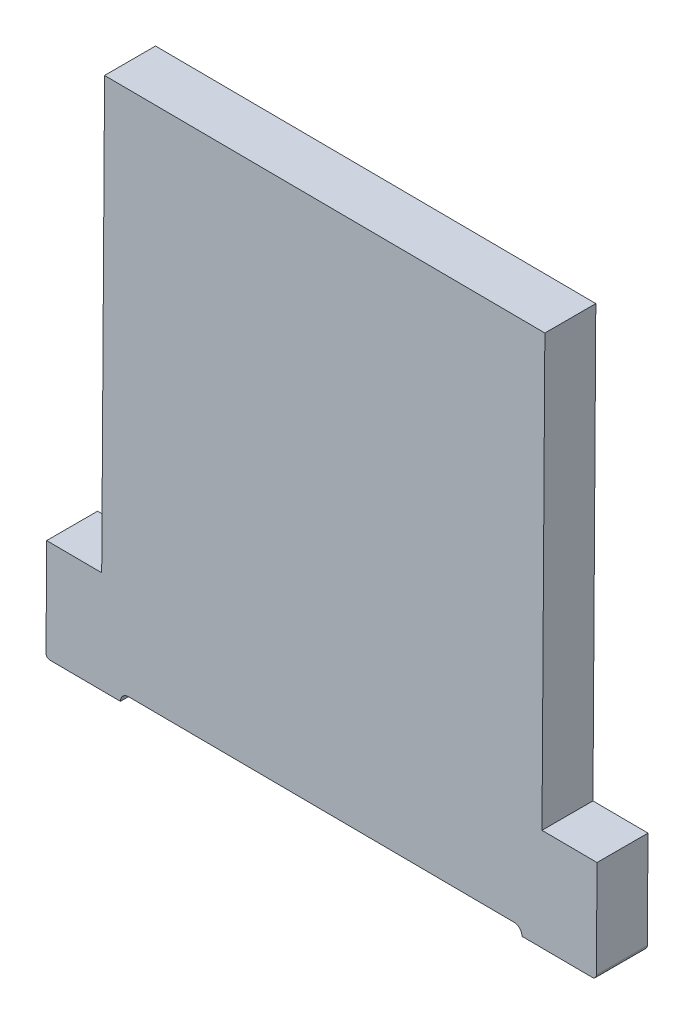
ISO-10303-21;
HEADER;
FILE_DESCRIPTION(('STEP AP214'),'2;1');
FILE_NAME('part.step','',(''),(''),'','','');
FILE_SCHEMA(('AUTOMOTIVE_DESIGN { 1 0 10303 214 1 1 1 1 }'));
ENDSEC;
DATA;
#1=APPLICATION_CONTEXT('core data for automotive mechanical design processes');
#2=APPLICATION_PROTOCOL_DEFINITION('international standard','automotive_design',2000,#1);
#3=PRODUCT_CONTEXT('',#1,'mechanical');
#4=PRODUCT('Part','Part','',(#3));
#5=PRODUCT_RELATED_PRODUCT_CATEGORY('part','',(#4));
#6=PRODUCT_DEFINITION_FORMATION('','',#4);
#7=PRODUCT_DEFINITION_CONTEXT('part definition',#1,'design');
#8=PRODUCT_DEFINITION('design','',#6,#7);
#9=PRODUCT_DEFINITION_SHAPE('','',#8);
#10=(LENGTH_UNIT() NAMED_UNIT(*) SI_UNIT(.MILLI.,.METRE.));
#11=(NAMED_UNIT(*) PLANE_ANGLE_UNIT() SI_UNIT($,.RADIAN.));
#12=(NAMED_UNIT(*) SI_UNIT($,.STERADIAN.) SOLID_ANGLE_UNIT());
#13=UNCERTAINTY_MEASURE_WITH_UNIT(LENGTH_MEASURE(1.E-05),#10,'distance_accuracy_value','');
#14=(GEOMETRIC_REPRESENTATION_CONTEXT(3) GLOBAL_UNCERTAINTY_ASSIGNED_CONTEXT((#13)) GLOBAL_UNIT_ASSIGNED_CONTEXT((#10,
#11,#12)) REPRESENTATION_CONTEXT('',''));
#15=CARTESIAN_POINT('',(0.,0.,0.));
#16=DIRECTION('',(0.,0.,1.));
#17=DIRECTION('',(1.,0.,0.));
#18=AXIS2_PLACEMENT_3D('',#15,#16,#17);
#19=CARTESIAN_POINT('',(199.358941614717,94.459484168649,142.211582908599));
#20=DIRECTION('',(0.00663069374923689,0.99997801670857,0.));
#21=DIRECTION('',(0.,0.,-1.));
#22=AXIS2_PLACEMENT_3D('',#19,#20,#21);
#23=PLANE('',#22);
#24=DIRECTION('',(0.,0.,1.));
#25=VECTOR('',#24,1.);
#26=CARTESIAN_POINT('',(199.358941614717,94.459484168649,142.211582908599));
#27=LINE('',#26,#25);
#28=CARTESIAN_POINT('',(199.358941614717,94.459484168649,142.211582908599));
#29=VERTEX_POINT('',#28);
#30=CARTESIAN_POINT('',(199.358941614717,94.459484168649,142.711582908599));
#31=VERTEX_POINT('',#30);
#32=EDGE_CURVE('E11',#29,#31,#27,.T.);
#33=ORIENTED_EDGE('',*,*,#32,.T.);
#34=DIRECTION('',(0.999978016708569,-0.00663069374923689,0.));
#35=VECTOR('',#34,1.);
#36=CARTESIAN_POINT('',(199.358941614717,94.459484168649,142.711582908599));
#37=LINE('',#36,#35);
#38=CARTESIAN_POINT('',(199.898929743739,94.4559035940244,142.711582908599));
#39=VERTEX_POINT('',#38);
#40=EDGE_CURVE('E55',#31,#39,#37,.T.);
#41=ORIENTED_EDGE('',*,*,#40,.T.);
#42=DIRECTION('',(0.,0.,1.));
#43=VECTOR('',#42,1.);
#44=CARTESIAN_POINT('',(199.898929743739,94.4559035940244,142.211582908599));
#45=LINE('',#44,#43);
#46=CARTESIAN_POINT('',(199.898929743739,94.4559035940244,142.211582908599));
#47=VERTEX_POINT('',#46);
#48=EDGE_CURVE('E244',#47,#39,#45,.T.);
#49=ORIENTED_EDGE('',*,*,#48,.F.);
#50=DIRECTION('',(0.999978016708569,-0.00663069374923689,0.));
#51=VECTOR('',#50,1.);
#52=CARTESIAN_POINT('',(199.358941614717,94.459484168649,142.211582908599));
#53=LINE('',#52,#51);
#54=EDGE_CURVE('E216',#29,#47,#53,.T.);
#55=ORIENTED_EDGE('',*,*,#54,.F.);
#56=EDGE_LOOP('',(#33,#41,#49,#55));
#57=FACE_BOUND('',#56,.T.);
#58=ADVANCED_FACE('F44',(#57),#23,.T.);
#59=CARTESIAN_POINT('',(199.898929743739,94.4559035940244,142.211582908599));
#60=DIRECTION('',(-0.99997801670857,0.00663069374923689,0.));
#61=DIRECTION('',(0.,0.,1.));
#62=AXIS2_PLACEMENT_3D('',#59,#60,#61);
#63=PLANE('',#62);
#64=ORIENTED_EDGE('',*,*,#48,.T.);
#65=DIRECTION('',(0.00663069374923689,0.999978016708569,0.));
#66=VECTOR('',#65,1.);
#67=CARTESIAN_POINT('',(199.898929743739,94.4559035940244,142.711582908599));
#68=LINE('',#67,#66);
#69=CARTESIAN_POINT('',(199.927043885236,98.6958103848688,142.711582908599));
#70=VERTEX_POINT('',#69);
#71=EDGE_CURVE('E240',#39,#70,#68,.T.);
#72=ORIENTED_EDGE('',*,*,#71,.T.);
#73=DIRECTION('',(0.,0.,1.));
#74=VECTOR('',#73,1.);
#75=CARTESIAN_POINT('',(199.927043885236,98.6958103848688,142.211582908599));
#76=LINE('',#75,#74);
#77=CARTESIAN_POINT('',(199.927043885236,98.6958103848688,142.211582908599));
#78=VERTEX_POINT('',#77);
#79=EDGE_CURVE('E245',#78,#70,#76,.T.);
#80=ORIENTED_EDGE('',*,*,#79,.F.);
#81=DIRECTION('',(0.00663069374923689,0.999978016708569,0.));
#82=VECTOR('',#81,1.);
#83=CARTESIAN_POINT('',(199.898929743739,94.4559035940244,142.211582908599));
#84=LINE('',#83,#82);
#85=EDGE_CURVE('E231',#47,#78,#84,.T.);
#86=ORIENTED_EDGE('',*,*,#85,.F.);
#87=EDGE_LOOP('',(#64,#72,#80,#86));
#88=FACE_BOUND('',#87,.T.);
#89=ADVANCED_FACE('F344',(#88),#63,.T.);
#90=CARTESIAN_POINT('',(199.927043885236,98.6958103848688,142.211582908599));
#91=DIRECTION('',(0.00663069374923689,0.99997801670857,0.));
#92=DIRECTION('',(0.,0.,-1.));
#93=AXIS2_PLACEMENT_3D('',#90,#91,#92);
#94=PLANE('',#93);
#95=ORIENTED_EDGE('',*,*,#79,.T.);
#96=DIRECTION('',(0.999978016708569,-0.00663069374923689,0.));
#97=VECTOR('',#96,1.);
#98=CARTESIAN_POINT('',(199.927043885236,98.6958103848688,142.711582908599));
#99=LINE('',#98,#97);
#100=CARTESIAN_POINT('',(204.246948917417,98.6671657878721,142.711582908599));
#101=VERTEX_POINT('',#100);
#102=EDGE_CURVE('E210',#70,#101,#99,.T.);
#103=ORIENTED_EDGE('',*,*,#102,.T.);
#104=DIRECTION('',(0.,0.,1.));
#105=VECTOR('',#104,1.);
#106=CARTESIAN_POINT('',(204.246948917417,98.6671657878721,142.211582908599));
#107=LINE('',#106,#105);
#108=CARTESIAN_POINT('',(204.246948917417,98.6671657878721,142.211582908599));
#109=VERTEX_POINT('',#108);
#110=EDGE_CURVE('E207',#109,#101,#107,.T.);
#111=ORIENTED_EDGE('',*,*,#110,.F.);
#112=DIRECTION('',(0.999978016708569,-0.00663069374923689,0.));
#113=VECTOR('',#112,1.);
#114=CARTESIAN_POINT('',(199.927043885236,98.6958103848688,142.211582908599));
#115=LINE('',#114,#113);
#116=EDGE_CURVE('E236',#78,#109,#115,.T.);
#117=ORIENTED_EDGE('',*,*,#116,.F.);
#118=EDGE_LOOP('',(#95,#103,#111,#117));
#119=FACE_BOUND('',#118,.T.);
#120=ADVANCED_FACE('F370',(#119),#94,.T.);
#121=CARTESIAN_POINT('',(204.246948917417,98.6671657878721,142.211582908599));
#122=DIRECTION('',(0.99997801670857,-0.00663069374923689,0.));
#123=DIRECTION('',(0.,0.,-1.));
#124=AXIS2_PLACEMENT_3D('',#121,#122,#123);
#125=PLANE('',#124);
#126=ORIENTED_EDGE('',*,*,#110,.T.);
#127=DIRECTION('',(-0.00663069374923689,-0.999978016708569,0.));
#128=VECTOR('',#127,1.);
#129=CARTESIAN_POINT('',(204.246948917417,98.6671657878721,142.711582908599));
#130=LINE('',#129,#128);
#131=CARTESIAN_POINT('',(204.21883477592,94.4272589970277,142.711582908599));
#132=VERTEX_POINT('',#131);
#133=EDGE_CURVE('E211',#101,#132,#130,.T.);
#134=ORIENTED_EDGE('',*,*,#133,.T.);
#135=DIRECTION('',(0.,0.,1.));
#136=VECTOR('',#135,1.);
#137=CARTESIAN_POINT('',(204.21883477592,94.4272589970277,142.211582908599));
#138=LINE('',#137,#136);
#139=CARTESIAN_POINT('',(204.21883477592,94.4272589970277,142.211582908599));
#140=VERTEX_POINT('',#139);
#141=EDGE_CURVE('E270',#140,#132,#138,.T.);
#142=ORIENTED_EDGE('',*,*,#141,.F.);
#143=DIRECTION('',(-0.00663069374923689,-0.999978016708569,0.));
#144=VECTOR('',#143,1.);
#145=CARTESIAN_POINT('',(204.246948917417,98.6671657878721,142.211582908599));
#146=LINE('',#145,#144);
#147=EDGE_CURVE('E239',#109,#140,#146,.T.);
#148=ORIENTED_EDGE('',*,*,#147,.F.);
#149=EDGE_LOOP('',(#126,#134,#142,#148));
#150=FACE_BOUND('',#149,.T.);
#151=ADVANCED_FACE('F46',(#150),#125,.T.);
#152=CARTESIAN_POINT('',(204.21883477592,94.4272589970277,142.211582908599));
#153=DIRECTION('',(0.00663069374923689,0.99997801670857,0.));
#154=DIRECTION('',(0.,0.,-1.));
#155=AXIS2_PLACEMENT_3D('',#152,#153,#154);
#156=PLANE('',#155);
#157=ORIENTED_EDGE('',*,*,#141,.T.);
#158=DIRECTION('',(0.999978016708569,-0.00663069374923689,0.));
#159=VECTOR('',#158,1.);
#160=CARTESIAN_POINT('',(204.21883477592,94.4272589970277,142.711582908599));
#161=LINE('',#160,#159);
#162=CARTESIAN_POINT('',(204.758822904942,94.4236784224032,142.711582908599));
#163=VERTEX_POINT('',#162);
#164=EDGE_CURVE('E206',#132,#163,#161,.T.);
#165=ORIENTED_EDGE('',*,*,#164,.T.);
#166=DIRECTION('',(0.,0.,1.));
#167=VECTOR('',#166,1.);
#168=CARTESIAN_POINT('',(204.758822904942,94.4236784224032,142.211582908599));
#169=LINE('',#168,#167);
#170=CARTESIAN_POINT('',(204.758822904942,94.4236784224032,142.211582908599));
#171=VERTEX_POINT('',#170);
#172=EDGE_CURVE('E203',#171,#163,#169,.T.);
#173=ORIENTED_EDGE('',*,*,#172,.F.);
#174=DIRECTION('',(0.999978016708569,-0.00663069374923689,0.));
#175=VECTOR('',#174,1.);
#176=CARTESIAN_POINT('',(204.21883477592,94.4272589970277,142.211582908599));
#177=LINE('',#176,#175);
#178=EDGE_CURVE('E220',#140,#171,#177,.T.);
#179=ORIENTED_EDGE('',*,*,#178,.F.);
#180=EDGE_LOOP('',(#157,#165,#173,#179));
#181=FACE_BOUND('',#180,.T.);
#182=ADVANCED_FACE('F286',(#181),#156,.T.);
#183=CARTESIAN_POINT('',(204.758822904942,94.4236784224032,142.211582908599));
#184=DIRECTION('',(0.99997801670857,-0.00663069374923689,0.));
#185=DIRECTION('',(0.,0.,-1.));
#186=AXIS2_PLACEMENT_3D('',#183,#184,#185);
#187=PLANE('',#186);
#188=DIRECTION('',(-0.00663069374923689,-0.999978016708569,0.));
#189=VECTOR('',#188,1.);
#190=CARTESIAN_POINT('',(204.758822904942,94.4236784224032,142.211582908599));
#191=LINE('',#190,#189);
#192=CARTESIAN_POINT('',(204.752457438943,93.4636995263629,142.211582908599));
#193=VERTEX_POINT('',#192);
#194=EDGE_CURVE('E217',#171,#193,#191,.T.);
#195=ORIENTED_EDGE('',*,*,#194,.F.);
#196=ORIENTED_EDGE('',*,*,#172,.T.);
#197=DIRECTION('',(-0.00663069374923689,-0.999978016708569,0.));
#198=VECTOR('',#197,1.);
#199=CARTESIAN_POINT('',(204.758822904942,94.4236784224032,142.711582908599));
#200=LINE('',#199,#198);
#201=CARTESIAN_POINT('',(204.752457438943,93.4636995263629,142.711582908599));
#202=VERTEX_POINT('',#201);
#203=EDGE_CURVE('E200',#163,#202,#200,.T.);
#204=ORIENTED_EDGE('',*,*,#203,.T.);
#205=DIRECTION('',(0.,0.,1.));
#206=VECTOR('',#205,1.);
#207=CARTESIAN_POINT('',(204.752457438943,93.4636995263629,142.211582908599));
#208=LINE('',#207,#206);
#209=EDGE_CURVE('E201',#193,#202,#208,.T.);
#210=ORIENTED_EDGE('',*,*,#209,.F.);
#211=EDGE_LOOP('',(#195,#196,#204,#210));
#212=FACE_BOUND('',#211,.T.);
#213=ADVANCED_FACE('F290',(#212),#187,.T.);
#214=CARTESIAN_POINT('',(204.712458318275,93.4639647541129,142.211582908599));
#215=DIRECTION('',(0.,0.,1.));
#216=DIRECTION('',(-0.00663069374892583,-0.999978016708571,0.));
#217=AXIS2_PLACEMENT_3D('',#214,#215,#216);
#218=CYLINDRICAL_SURFACE('',#217,0.0400000000000063);
#219=CARTESIAN_POINT('',(204.712458318275,93.4639647541129,142.211582908599));
#220=DIRECTION('',(0.,0.,1.));
#221=DIRECTION('',(-0.999978016708569,0.00663069374927276,0.));
#222=AXIS2_PLACEMENT_3D('',#219,#220,#221);
#223=CIRCLE('',#222,0.0400000000000065);
#224=CARTESIAN_POINT('',(204.712193090525,93.4239656334445,142.211582908599));
#225=VERTEX_POINT('',#224);
#226=EDGE_CURVE('E197',#225,#193,#223,.T.);
#227=ORIENTED_EDGE('',*,*,#226,.T.);
#228=ORIENTED_EDGE('',*,*,#209,.T.);
#229=CARTESIAN_POINT('',(204.712458318275,93.4639647541129,142.711582908599));
#230=DIRECTION('',(0.,0.,1.));
#231=DIRECTION('',(-0.999978016708569,0.00663069374927276,0.));
#232=AXIS2_PLACEMENT_3D('',#229,#230,#231);
#233=CIRCLE('',#232,0.0400000000000065);
#234=CARTESIAN_POINT('',(204.712193090525,93.4239656334445,142.711582908599));
#235=VERTEX_POINT('',#234);
#236=EDGE_CURVE('E181',#235,#202,#233,.T.);
#237=ORIENTED_EDGE('',*,*,#236,.F.);
#238=DIRECTION('',(0.,0.,1.));
#239=VECTOR('',#238,1.);
#240=CARTESIAN_POINT('',(204.712193090525,93.4239656334445,142.211582908599));
#241=LINE('',#240,#239);
#242=EDGE_CURVE('E196',#225,#235,#241,.T.);
#243=ORIENTED_EDGE('',*,*,#242,.F.);
#244=EDGE_LOOP('',(#227,#228,#237,#243));
#245=FACE_BOUND('',#244,.T.);
#246=ADVANCED_FACE('F293',(#245),#218,.T.);
#247=CARTESIAN_POINT('',(202.05225156608,93.4416032788175,142.211582908599));
#248=DIRECTION('',(-0.00663069374923689,-0.99997801670857,0.));
#249=DIRECTION('',(-0.99997801670857,0.00663069374923689,0.));
#250=AXIS2_PLACEMENT_3D('',#247,#248,#249);
#251=PLANE('',#250);
#252=DIRECTION('',(0.,0.,-1.));
#253=VECTOR('',#252,1.);
#254=CARTESIAN_POINT('',(204.022208258996,93.4285408121315,142.211582908599));
#255=LINE('',#254,#253);
#256=CARTESIAN_POINT('',(204.022208258996,93.4285408121315,142.711582908599));
#257=VERTEX_POINT('',#256);
#258=CARTESIAN_POINT('',(204.022208258996,93.4285408121315,142.211582908599));
#259=VERTEX_POINT('',#258);
#260=EDGE_CURVE('E48',#257,#259,#255,.T.);
#261=ORIENTED_EDGE('',*,*,#260,.T.);
#262=DIRECTION('',(0.999978016708569,-0.00663069374923689,0.));
#263=VECTOR('',#262,1.);
#264=CARTESIAN_POINT('',(199.352310920967,93.4595061519404,142.211582908599));
#265=LINE('',#264,#263);
#266=EDGE_CURVE('E192',#259,#225,#265,.T.);
#267=ORIENTED_EDGE('',*,*,#266,.T.);
#268=ORIENTED_EDGE('',*,*,#242,.T.);
#269=DIRECTION('',(-0.999978016708569,0.00663069374923689,0.));
#270=VECTOR('',#269,1.);
#271=CARTESIAN_POINT('',(204.752192211193,93.4237004056946,142.711582908599));
#272=LINE('',#271,#270);
#273=EDGE_CURVE('E232',#235,#257,#272,.T.);
#274=ORIENTED_EDGE('',*,*,#273,.T.);
#275=EDGE_LOOP('',(#261,#267,#268,#274));
#276=FACE_BOUND('',#275,.T.);
#277=ADVANCED_FACE('F298',(#276),#251,.T.);
#278=CARTESIAN_POINT('',(203.94221001766,93.4290712676314,142.211582908599));
#279=DIRECTION('',(0.,0.,-1.));
#280=DIRECTION('',(-0.00663069374927391,-0.999978016708569,0.));
#281=AXIS2_PLACEMENT_3D('',#278,#279,#280);
#282=CYLINDRICAL_SURFACE('',#281,0.079999999999999);
#283=CARTESIAN_POINT('',(203.94221001766,93.4290712676314,142.211582908599));
#284=DIRECTION('',(0.,0.,1.));
#285=DIRECTION('',(-0.00663069374927391,-0.999978016708569,0.));
#286=AXIS2_PLACEMENT_3D('',#283,#284,#285);
#287=CIRCLE('',#286,0.079999999999999);
#288=CARTESIAN_POINT('',(203.942740473159,93.5090695089681,142.211582908599));
#289=VERTEX_POINT('',#288);
#290=EDGE_CURVE('E221',#259,#289,#287,.T.);
#291=ORIENTED_EDGE('',*,*,#290,.F.);
#292=ORIENTED_EDGE('',*,*,#260,.F.);
#293=CARTESIAN_POINT('',(203.94221001766,93.4290712676314,142.711582908599));
#294=DIRECTION('',(0.,0.,-1.));
#295=DIRECTION('',(-0.00663069374927391,-0.999978016708569,0.));
#296=AXIS2_PLACEMENT_3D('',#293,#294,#295);
#297=CIRCLE('',#296,0.079999999999999);
#298=CARTESIAN_POINT('',(203.942740473159,93.5090695089681,142.711582908599));
#299=VERTEX_POINT('',#298);
#300=EDGE_CURVE('E187',#299,#257,#297,.T.);
#301=ORIENTED_EDGE('',*,*,#300,.F.);
#302=DIRECTION('',(0.,0.,1.));
#303=VECTOR('',#302,1.);
#304=CARTESIAN_POINT('',(203.942740473159,93.5090695089681,142.211582908599));
#305=LINE('',#304,#303);
#306=EDGE_CURVE('E235',#289,#299,#305,.T.);
#307=ORIENTED_EDGE('',*,*,#306,.F.);
#308=EDGE_LOOP('',(#291,#292,#301,#307));
#309=FACE_BOUND('',#308,.T.);
#310=ADVANCED_FACE('F306',(#309),#282,.F.);
#311=CARTESIAN_POINT('',(203.942740473159,93.5090695089681,142.211582908599));
#312=DIRECTION('',(-0.00663069374923689,-0.99997801670857,0.));
#313=DIRECTION('',(-0.99997801670857,0.00663069374923689,0.));
#314=AXIS2_PLACEMENT_3D('',#311,#312,#313);
#315=PLANE('',#314);
#316=ORIENTED_EDGE('',*,*,#306,.T.);
#317=DIRECTION('',(-0.999978016708569,0.00663069374923689,0.));
#318=VECTOR('',#317,1.);
#319=CARTESIAN_POINT('',(203.942740473159,93.5090695089681,142.711582908599));
#320=LINE('',#319,#318);
#321=CARTESIAN_POINT('',(200.162823570001,93.5341335313402,142.711582908599));
#322=VERTEX_POINT('',#321);
#323=EDGE_CURVE('E249',#299,#322,#320,.T.);
#324=ORIENTED_EDGE('',*,*,#323,.T.);
#325=DIRECTION('',(0.,0.,1.));
#326=VECTOR('',#325,1.);
#327=CARTESIAN_POINT('',(200.162823570001,93.5341335313402,142.211582908599));
#328=LINE('',#327,#326);
#329=CARTESIAN_POINT('',(200.162823570001,93.5341335313402,142.211582908599));
#330=VERTEX_POINT('',#329);
#331=EDGE_CURVE('E222',#330,#322,#328,.T.);
#332=ORIENTED_EDGE('',*,*,#331,.F.);
#333=DIRECTION('',(-0.999978016708569,0.00663069374923689,0.));
#334=VECTOR('',#333,1.);
#335=CARTESIAN_POINT('',(203.942740473159,93.5090695089681,142.211582908599));
#336=LINE('',#335,#334);
#337=EDGE_CURVE('E260',#289,#330,#336,.T.);
#338=ORIENTED_EDGE('',*,*,#337,.F.);
#339=EDGE_LOOP('',(#316,#324,#332,#338));
#340=FACE_BOUND('',#339,.T.);
#341=ADVANCED_FACE('F388',(#340),#315,.T.);
#342=CARTESIAN_POINT('',(199.352310920967,93.4595061519404,142.211582908599));
#343=DIRECTION('',(-0.99997801670857,0.00663069374923689,0.));
#344=DIRECTION('',(0.,0.,1.));
#345=AXIS2_PLACEMENT_3D('',#342,#343,#344);
#346=PLANE('',#345);
#347=DIRECTION('',(0.00663069374923689,0.999978016708569,0.));
#348=VECTOR('',#347,1.);
#349=CARTESIAN_POINT('',(199.352310920967,93.4595061519404,142.211582908599));
#350=LINE('',#349,#348);
#351=CARTESIAN_POINT('',(199.352576148717,93.4995052726088,142.211582908599));
#352=VERTEX_POINT('',#351);
#353=EDGE_CURVE('E212',#352,#29,#350,.T.);
#354=ORIENTED_EDGE('',*,*,#353,.F.);
#355=DIRECTION('',(0.,0.,1.));
#356=VECTOR('',#355,1.);
#357=CARTESIAN_POINT('',(199.352576148717,93.4995052726088,142.211582908599));
#358=LINE('',#357,#356);
#359=CARTESIAN_POINT('',(199.352576148717,93.4995052726088,142.711582908599));
#360=VERTEX_POINT('',#359);
#361=EDGE_CURVE('E252',#352,#360,#358,.T.);
#362=ORIENTED_EDGE('',*,*,#361,.T.);
#363=DIRECTION('',(0.00663069374923689,0.999978016708569,0.));
#364=VECTOR('',#363,1.);
#365=CARTESIAN_POINT('',(199.352310920967,93.4595061519404,142.711582908599));
#366=LINE('',#365,#364);
#367=EDGE_CURVE('E170',#360,#31,#366,.T.);
#368=ORIENTED_EDGE('',*,*,#367,.T.);
#369=ORIENTED_EDGE('',*,*,#32,.F.);
#370=EDGE_LOOP('',(#354,#362,#368,#369));
#371=FACE_BOUND('',#370,.T.);
#372=ADVANCED_FACE('F392',(#371),#346,.T.);
#373=CARTESIAN_POINT('',(202.068197138176,95.8463624432088,142.211582908599));
#374=DIRECTION('',(0.,0.,-1.));
#375=DIRECTION('',(0.,-1.,0.));
#376=AXIS2_PLACEMENT_3D('',#373,#374,#375);
#377=PLANE('',#376);
#378=DIRECTION('',(0.999978016708569,-0.00663069374923689,0.));
#379=VECTOR('',#378,1.);
#380=CARTESIAN_POINT('',(199.352310920967,93.4595061519404,142.211582908599));
#381=LINE('',#380,#379);
#382=CARTESIAN_POINT('',(199.392310041635,93.4592409241905,142.211582908599));
#383=VERTEX_POINT('',#382);
#384=CARTESIAN_POINT('',(200.082294873164,93.4546657455035,142.211582908599));
#385=VERTEX_POINT('',#384);
#386=EDGE_CURVE('E164',#383,#385,#381,.T.);
#387=ORIENTED_EDGE('',*,*,#386,.F.);
#388=CARTESIAN_POINT('',(199.392575269386,93.4992400448588,142.211582908599));
#389=DIRECTION('',(0.,0.,-1.));
#390=DIRECTION('',(-0.999978016708569,0.00663069374927276,0.));
#391=AXIS2_PLACEMENT_3D('',#388,#389,#390);
#392=CIRCLE('',#391,0.0400000000000065);
#393=EDGE_CURVE('E179',#383,#352,#392,.T.);
#394=ORIENTED_EDGE('',*,*,#393,.T.);
#395=ORIENTED_EDGE('',*,*,#353,.T.);
#396=ORIENTED_EDGE('',*,*,#54,.T.);
#397=ORIENTED_EDGE('',*,*,#85,.T.);
#398=ORIENTED_EDGE('',*,*,#116,.T.);
#399=ORIENTED_EDGE('',*,*,#147,.T.);
#400=ORIENTED_EDGE('',*,*,#178,.T.);
#401=ORIENTED_EDGE('',*,*,#194,.T.);
#402=ORIENTED_EDGE('',*,*,#226,.F.);
#403=ORIENTED_EDGE('',*,*,#266,.F.);
#404=ORIENTED_EDGE('',*,*,#290,.T.);
#405=ORIENTED_EDGE('',*,*,#337,.T.);
#406=CARTESIAN_POINT('',(200.162293114501,93.4541352900036,142.211582908599));
#407=DIRECTION('',(0.,0.,1.));
#408=DIRECTION('',(-0.00663069374927391,-0.999978016708569,0.));
#409=AXIS2_PLACEMENT_3D('',#406,#407,#408);
#410=CIRCLE('',#409,0.079999999999999);
#411=EDGE_CURVE('E256',#330,#385,#410,.T.);
#412=ORIENTED_EDGE('',*,*,#411,.T.);
#413=EDGE_LOOP('',(#387,#394,#395,#396,#397,#398,#399,#400,#401,#402,#403,#404,#405,#412));
#414=FACE_BOUND('',#413,.T.);
#415=ADVANCED_FACE('F277',(#414),#377,.T.);
#416=CARTESIAN_POINT('',(200.162293114501,93.4541352900036,142.211582908599));
#417=DIRECTION('',(0.,0.,-1.));
#418=DIRECTION('',(-0.00663069374927391,-0.999978016708569,0.));
#419=AXIS2_PLACEMENT_3D('',#416,#417,#418);
#420=CYLINDRICAL_SURFACE('',#419,0.079999999999999);
#421=DIRECTION('',(0.,0.,-1.));
#422=VECTOR('',#421,1.);
#423=CARTESIAN_POINT('',(200.082294873164,93.4546657455035,142.211582908599));
#424=LINE('',#423,#422);
#425=CARTESIAN_POINT('',(200.082294873164,93.4546657455035,142.711582908599));
#426=VERTEX_POINT('',#425);
#427=EDGE_CURVE('E161',#426,#385,#424,.T.);
#428=ORIENTED_EDGE('',*,*,#427,.T.);
#429=ORIENTED_EDGE('',*,*,#411,.F.);
#430=ORIENTED_EDGE('',*,*,#331,.T.);
#431=CARTESIAN_POINT('',(200.162293114501,93.4541352900036,142.711582908599));
#432=DIRECTION('',(0.,0.,-1.));
#433=DIRECTION('',(-0.00663069374927391,-0.999978016708569,0.));
#434=AXIS2_PLACEMENT_3D('',#431,#432,#433);
#435=CIRCLE('',#434,0.079999999999999);
#436=EDGE_CURVE('E226',#426,#322,#435,.T.);
#437=ORIENTED_EDGE('',*,*,#436,.F.);
#438=EDGE_LOOP('',(#428,#429,#430,#437));
#439=FACE_BOUND('',#438,.T.);
#440=ADVANCED_FACE('F323',(#439),#420,.F.);
#441=CARTESIAN_POINT('',(202.068197138176,95.8463624432088,142.711582908599));
#442=DIRECTION('',(0.,0.,-1.));
#443=DIRECTION('',(0.,-1.,0.));
#444=AXIS2_PLACEMENT_3D('',#441,#442,#443);
#445=PLANE('',#444);
#446=DIRECTION('',(-0.999978016708569,0.00663069374923689,0.));
#447=VECTOR('',#446,1.);
#448=CARTESIAN_POINT('',(204.752192211193,93.4237004056946,142.711582908599));
#449=LINE('',#448,#447);
#450=CARTESIAN_POINT('',(199.392310041635,93.4592409241905,142.711582908599));
#451=VERTEX_POINT('',#450);
#452=EDGE_CURVE('E155',#426,#451,#449,.T.);
#453=ORIENTED_EDGE('',*,*,#452,.F.);
#454=ORIENTED_EDGE('',*,*,#436,.T.);
#455=ORIENTED_EDGE('',*,*,#323,.F.);
#456=ORIENTED_EDGE('',*,*,#300,.T.);
#457=ORIENTED_EDGE('',*,*,#273,.F.);
#458=ORIENTED_EDGE('',*,*,#236,.T.);
#459=ORIENTED_EDGE('',*,*,#203,.F.);
#460=ORIENTED_EDGE('',*,*,#164,.F.);
#461=ORIENTED_EDGE('',*,*,#133,.F.);
#462=ORIENTED_EDGE('',*,*,#102,.F.);
#463=ORIENTED_EDGE('',*,*,#71,.F.);
#464=ORIENTED_EDGE('',*,*,#40,.F.);
#465=ORIENTED_EDGE('',*,*,#367,.F.);
#466=CARTESIAN_POINT('',(199.392575269386,93.4992400448588,142.711582908599));
#467=DIRECTION('',(0.,0.,-1.));
#468=DIRECTION('',(-0.999978016708569,0.00663069374927276,0.));
#469=AXIS2_PLACEMENT_3D('',#466,#467,#468);
#470=CIRCLE('',#469,0.0400000000000065);
#471=EDGE_CURVE('E167',#451,#360,#470,.T.);
#472=ORIENTED_EDGE('',*,*,#471,.F.);
#473=EDGE_LOOP('',(#453,#454,#455,#456,#457,#458,#459,#460,#461,#462,#463,#464,#465,#472));
#474=FACE_BOUND('',#473,.T.);
#475=ADVANCED_FACE('F168',(#474),#445,.F.);
#476=CARTESIAN_POINT('',(199.392575269386,93.4992400448588,142.211582908599));
#477=DIRECTION('',(0.,0.,1.));
#478=DIRECTION('',(-0.00663069374892583,-0.999978016708571,0.));
#479=AXIS2_PLACEMENT_3D('',#476,#477,#478);
#480=CYLINDRICAL_SURFACE('',#479,0.0400000000000063);
#481=DIRECTION('',(0.,0.,1.));
#482=VECTOR('',#481,1.);
#483=CARTESIAN_POINT('',(199.392310041635,93.4592409241905,142.211582908599));
#484=LINE('',#483,#482);
#485=EDGE_CURVE('E159',#383,#451,#484,.T.);
#486=ORIENTED_EDGE('',*,*,#485,.T.);
#487=ORIENTED_EDGE('',*,*,#471,.T.);
#488=ORIENTED_EDGE('',*,*,#361,.F.);
#489=ORIENTED_EDGE('',*,*,#393,.F.);
#490=EDGE_LOOP('',(#486,#487,#488,#489));
#491=FACE_BOUND('',#490,.T.);
#492=ADVANCED_FACE('F177',(#491),#480,.T.);
#493=CARTESIAN_POINT('',(202.05225156608,93.4416032788175,142.211582908599));
#494=DIRECTION('',(-0.00663069374923689,-0.99997801670857,0.));
#495=DIRECTION('',(-0.99997801670857,0.00663069374923689,0.));
#496=AXIS2_PLACEMENT_3D('',#493,#494,#495);
#497=PLANE('',#496);
#498=ORIENTED_EDGE('',*,*,#485,.F.);
#499=ORIENTED_EDGE('',*,*,#386,.T.);
#500=ORIENTED_EDGE('',*,*,#427,.F.);
#501=ORIENTED_EDGE('',*,*,#452,.T.);
#502=EDGE_LOOP('',(#498,#499,#500,#501));
#503=FACE_BOUND('',#502,.T.);
#504=ADVANCED_FACE('F157',(#503),#497,.T.);
#505=CLOSED_SHELL('',(#58,#89,#120,#151,#182,#213,#246,#277,#310,#341,#372,#415,#440,#475,#492,#504));
#506=MANIFOLD_SOLID_BREP('B2',#505);
#507=ADVANCED_BREP_SHAPE_REPRESENTATION('',(#18,#506),#14);
#508=SHAPE_DEFINITION_REPRESENTATION(#9,#507);
ENDSEC;
END-ISO-10303-21;
